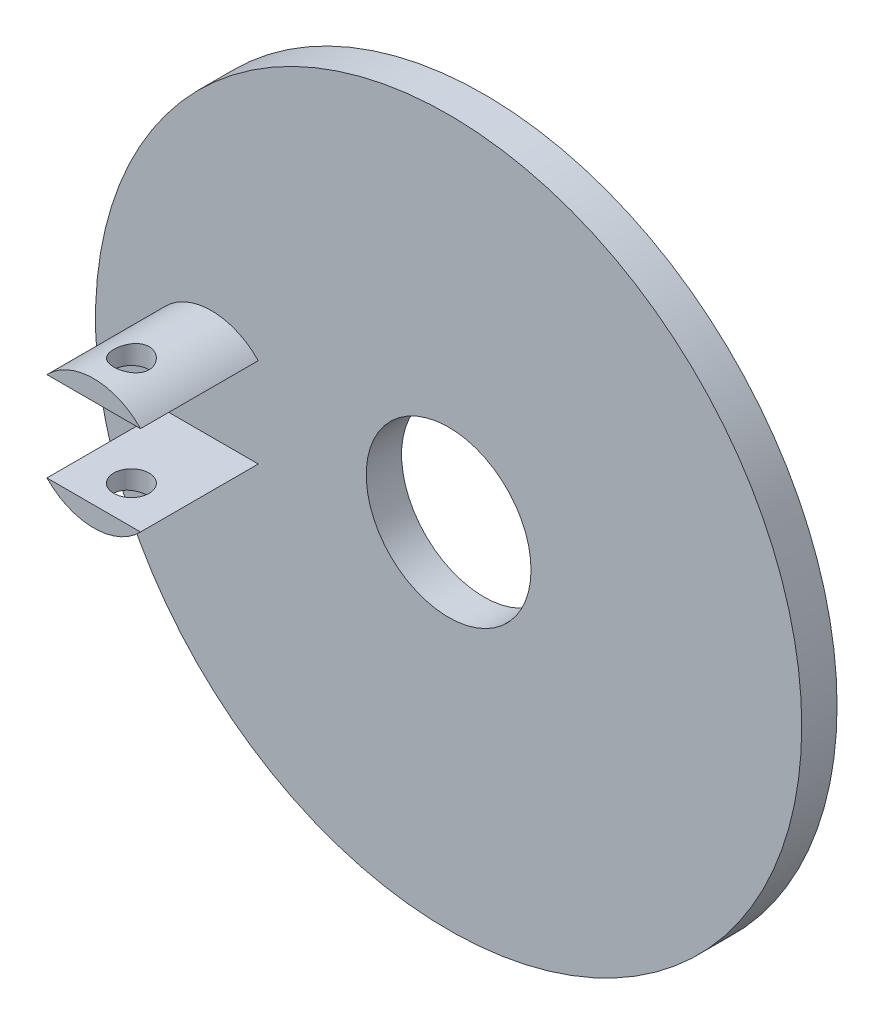
ISO-10303-21;
HEADER;
FILE_DESCRIPTION(('STEP AP214'),'2;1');
FILE_NAME('part.step','',(''),(''),'','','');
FILE_SCHEMA(('AUTOMOTIVE_DESIGN { 1 0 10303 214 1 1 1 1 }'));
ENDSEC;
DATA;
#1=APPLICATION_CONTEXT('core data for automotive mechanical design processes');
#2=APPLICATION_PROTOCOL_DEFINITION('international standard','automotive_design',2000,#1);
#3=PRODUCT_CONTEXT('',#1,'mechanical');
#4=PRODUCT('Part','Part','',(#3));
#5=PRODUCT_RELATED_PRODUCT_CATEGORY('part','',(#4));
#6=PRODUCT_DEFINITION_FORMATION('','',#4);
#7=PRODUCT_DEFINITION_CONTEXT('part definition',#1,'design');
#8=PRODUCT_DEFINITION('design','',#6,#7);
#9=PRODUCT_DEFINITION_SHAPE('','',#8);
#10=(LENGTH_UNIT() NAMED_UNIT(*) SI_UNIT(.MILLI.,.METRE.));
#11=(NAMED_UNIT(*) PLANE_ANGLE_UNIT() SI_UNIT($,.RADIAN.));
#12=(NAMED_UNIT(*) SI_UNIT($,.STERADIAN.) SOLID_ANGLE_UNIT());
#13=UNCERTAINTY_MEASURE_WITH_UNIT(LENGTH_MEASURE(1.E-05),#10,'distance_accuracy_value','');
#14=(GEOMETRIC_REPRESENTATION_CONTEXT(3) GLOBAL_UNCERTAINTY_ASSIGNED_CONTEXT((#13)) GLOBAL_UNIT_ASSIGNED_CONTEXT((#10,
#11,#12)) REPRESENTATION_CONTEXT('',''));
#15=CARTESIAN_POINT('',(0.,0.,0.));
#16=DIRECTION('',(0.,0.,1.));
#17=DIRECTION('',(1.,0.,0.));
#18=AXIS2_PLACEMENT_3D('',#15,#16,#17);
#19=CARTESIAN_POINT('',(-50.3744043567052,0.,32.5));
#20=DIRECTION('',(0.,0.,-1.));
#21=DIRECTION('',(-1.,0.,0.));
#22=AXIS2_PLACEMENT_3D('',#19,#20,#21);
#23=CYLINDRICAL_SURFACE('',#22,13.75);
#24=CARTESIAN_POINT('',(-50.3744043567052,13.75,28.25));
#25=CARTESIAN_POINT('',(-50.5809566400357,13.7499970679353,28.2499954684724));
#26=CARTESIAN_POINT('',(-50.787556803737,13.745300181519,28.2328773410415));
#27=CARTESIAN_POINT('',(-51.1947941820995,13.7270199521363,28.1649854242421));
#28=CARTESIAN_POINT('',(-51.3954286766484,13.7134326185125,28.1141965209285));
#29=CARTESIAN_POINT('',(-51.7847984218437,13.6788693043534,27.9807456706539));
#30=CARTESIAN_POINT('',(-51.9735490241306,13.6579030967349,27.8981258683452));
#31=CARTESIAN_POINT('',(-52.3345155971045,13.6107913603212,27.7035176683439));
#32=CARTESIAN_POINT('',(-52.5067302649297,13.5846454239129,27.5915269591152));
#33=CARTESIAN_POINT('',(-52.8338967256384,13.5292849260515,27.3385004088318));
#34=CARTESIAN_POINT('',(-52.9883921796301,13.5000160372607,27.1968863978645));
#35=CARTESIAN_POINT('',(-53.2717616987672,13.4420528233766,26.8898684099252));
#36=CARTESIAN_POINT('',(-53.4006323023233,13.4133585763801,26.7244612239942));
#37=CARTESIAN_POINT('',(-53.6313492201927,13.3592346040915,26.3708718810513));
#38=CARTESIAN_POINT('',(-53.7326650276449,13.3338732514656,26.1823321376593));
#39=CARTESIAN_POINT('',(-53.9019772657359,13.2900876852979,25.7900904295016));
#40=CARTESIAN_POINT('',(-53.9699801553763,13.2716621271439,25.5863914127788));
#41=CARTESIAN_POINT('',(-54.0691407677369,13.2443961798185,25.1746802624688));
#42=CARTESIAN_POINT('',(-54.101128370286,13.2353403070947,24.9668826295952));
#43=CARTESIAN_POINT('',(-54.1299384669336,13.2271957271021,24.548688292478));
#44=CARTESIAN_POINT('',(-54.1267678602273,13.2281050643315,24.33829210625));
#45=CARTESIAN_POINT('',(-54.0860091512128,13.2395956218864,23.9273961225843));
#46=CARTESIAN_POINT('',(-54.0494311984285,13.2498929578418,23.7267869134944));
#47=CARTESIAN_POINT('',(-53.9445164535004,13.2785438948515,23.334666784943));
#48=CARTESIAN_POINT('',(-53.8761770193214,13.2968981661038,23.1431566238343));
#49=CARTESIAN_POINT('',(-53.708870102367,13.3398404573081,22.7720661986314));
#50=CARTESIAN_POINT('',(-53.6095531537789,13.3644989941035,22.592651997416));
#51=CARTESIAN_POINT('',(-53.3833540572596,13.4172342199448,22.2526838814758));
#52=CARTESIAN_POINT('',(-53.2564662593605,13.4453116090812,22.0921338429031));
#53=CARTESIAN_POINT('',(-52.9735880237776,13.5028973747651,21.7886870254839));
#54=CARTESIAN_POINT('',(-52.8167509721234,13.5324218574279,21.6465813767777));
#55=CARTESIAN_POINT('',(-52.4811093861768,13.5887161926995,21.3905225875555));
#56=CARTESIAN_POINT('',(-52.3023039060016,13.6154859266073,21.2765706598759));
#57=CARTESIAN_POINT('',(-51.9265392410543,13.6634319530315,21.0796833180627));
#58=CARTESIAN_POINT('',(-51.7294984502497,13.6845812821826,20.9968966535401));
#59=CARTESIAN_POINT('',(-51.3235860784912,13.7187089035653,20.8658550687146));
#60=CARTESIAN_POINT('',(-51.1147172174994,13.7316890661141,20.8175922438897));
#61=CARTESIAN_POINT('',(-50.6978247829134,13.7477307194078,20.7582234555076));
#62=CARTESIAN_POINT('',(-50.4899651011652,13.7510790781342,20.7460425116991));
#63=CARTESIAN_POINT('',(-50.0751709426103,13.7483075396284,20.7562068687836));
#64=CARTESIAN_POINT('',(-49.868236367874,13.7421886695752,20.7785484240412));
#65=CARTESIAN_POINT('',(-49.4650416123563,13.7213559816487,20.8562437567578));
#66=CARTESIAN_POINT('',(-49.2686560460236,13.7067996618024,20.9109929818925));
#67=CARTESIAN_POINT('',(-48.8878796880836,13.6707480883919,21.0512431116013));
#68=CARTESIAN_POINT('',(-48.7034902284427,13.6492520658647,21.1367474241534));
#69=CARTESIAN_POINT('',(-48.3478014537188,13.6010393457039,21.338041105714));
#70=CARTESIAN_POINT('',(-48.176842850674,13.5742257387359,21.4544087181532));
#71=CARTESIAN_POINT('',(-47.8565038063779,13.518474710262,21.7134032188638));
#72=CARTESIAN_POINT('',(-47.7071278412602,13.4895368500677,21.8560355403964));
#73=CARTESIAN_POINT('',(-47.4296278480984,13.4317350389196,22.1685350950846));
#74=CARTESIAN_POINT('',(-47.3022636630283,13.4028986244354,22.3390834556873));
#75=CARTESIAN_POINT('',(-47.0779398015026,13.3495006548571,22.6997466180582));
#76=CARTESIAN_POINT('',(-46.9809789085436,13.3249389287407,22.8898606365564));
#77=CARTESIAN_POINT('',(-46.8209403987832,13.2831562169934,23.2833515705805));
#78=CARTESIAN_POINT('',(-46.7576705490722,13.2658937028182,23.4866456512007));
#79=CARTESIAN_POINT('',(-46.6663814262294,13.2406703654265,23.9015420949445));
#80=CARTESIAN_POINT('',(-46.6383526351345,13.2327070307137,24.1131421988357));
#81=CARTESIAN_POINT('',(-46.6189069672749,13.2272002418744,24.5308460095882));
#82=CARTESIAN_POINT('',(-46.6262660262878,13.2293083985106,24.7368889718698));
#83=CARTESIAN_POINT('',(-46.6745334156185,13.2428875416135,25.144676619382));
#84=CARTESIAN_POINT('',(-46.7154408059924,13.2543582657633,25.3464214248743));
#85=CARTESIAN_POINT('',(-46.8289191458226,13.2851579127739,25.7382657894222));
#86=CARTESIAN_POINT('',(-46.9012194704758,13.3044195782739,25.9284493830995));
#87=CARTESIAN_POINT('',(-47.0752217431718,13.3486297495706,26.2941331920382));
#88=CARTESIAN_POINT('',(-47.1769284940942,13.3735791841958,26.4696310026642));
#89=CARTESIAN_POINT('',(-47.4105185820836,13.4273094845813,26.8067764942303));
#90=CARTESIAN_POINT('',(-47.543231811152,13.4561843961411,26.9678342621074));
#91=CARTESIAN_POINT('',(-47.8335040767235,13.5139997622617,27.2657910169869));
#92=CARTESIAN_POINT('',(-47.9910692082353,13.54294023118,27.4026840600134));
#93=CARTESIAN_POINT('',(-48.33088504249,13.5984114794366,27.6514865362984));
#94=CARTESIAN_POINT('',(-48.5136146910489,13.6248726938459,27.7627587021674));
#95=CARTESIAN_POINT('',(-48.895904607107,13.6716315945094,27.9528310905287));
#96=CARTESIAN_POINT('',(-49.0954544756522,13.6919330537798,28.0316512013858));
#97=CARTESIAN_POINT('',(-49.4741541036597,13.7216048498941,28.1448487749475));
#98=CARTESIAN_POINT('',(-49.6517427560491,13.7321736920273,28.1841863781043));
#99=CARTESIAN_POINT('',(-50.0110103368515,13.7463721791088,28.2367625632971));
#100=CARTESIAN_POINT('',(-50.1926888177929,13.7500025795005,28.250003986637));
#101=CARTESIAN_POINT('',(-50.3744043567052,13.75,28.25));
#102=B_SPLINE_CURVE_WITH_KNOTS('',3,(#24,#25,#26,#27,#28,#29,#30,#31,#32,#33,#34,#35,#36,#37,
#38,#39,#40,#41,#42,#43,#44,#45,#46,#47,#48,#49,#50,#51,#52,#53,#54,#55,#56,#57,#58,#59,#60,#61,
#62,#63,#64,#65,#66,#67,#68,#69,#70,#71,#72,#73,#74,#75,#76,#77,#78,#79,#80,#81,#82,#83,#84,#85,
#86,#87,#88,#89,#90,#91,#92,#93,#94,#95,#96,#97,#98,#99,#100,#101),.UNSPECIFIED.,.T.,.F.,(4,2,2,
2,2,2,2,2,2,2,2,2,2,2,2,2,2,2,2,2,2,2,2,2,2,2,2,2,2,2,2,2,2,2,2,2,2,2,4),(0.,0.618990267137247,
1.23825857137825,1.85670975605145,2.47520962841177,3.10714695557947,3.73916959148309,
4.38261484125548,5.02593528477491,5.65410762152314,6.28215669241344,6.89182216687217,
7.50153836459292,8.1183981691982,8.73538450347804,9.37346321376938,10.0115694071106,
10.6526837434007,11.2936512441736,11.9153202835771,12.5369218776313,13.1472777800049,
13.7577013368959,14.380486725242,15.0034010914001,15.6447518266217,16.2860768966978,
16.9237024114271,17.5611556781934,18.1767213058417,18.7922696874019,19.4026138915576,
20.0130578381019,20.6422252849645,21.2715472777866,21.9151468073887,22.5583513153481,
23.102970802492,23.6475309891948),.UNSPECIFIED.);
#103=CARTESIAN_POINT('',(-50.3744043567052,13.75,28.25));
#104=VERTEX_POINT('',#103);
#105=EDGE_CURVE('E156',#104,#104,#102,.T.);
#106=ORIENTED_EDGE('',*,*,#105,.T.);
#107=EDGE_LOOP('',(#106));
#108=FACE_BOUND('',#107,.T.);
#109=DIRECTION('',(0.,0.,1.));
#110=VECTOR('',#109,1.);
#111=CARTESIAN_POINT('',(-60.3148520327408,9.5,-206.753354699524));
#112=LINE('',#111,#110);
#113=CARTESIAN_POINT('',(-60.3148520327408,9.5,7.50000000000001));
#114=VERTEX_POINT('',#113);
#115=CARTESIAN_POINT('',(-60.3148520327408,9.5,32.5));
#116=VERTEX_POINT('',#115);
#117=EDGE_CURVE('E92',#114,#116,#112,.T.);
#118=ORIENTED_EDGE('',*,*,#117,.T.);
#119=CARTESIAN_POINT('',(-50.3744043567052,0.,32.5));
#120=DIRECTION('',(0.,0.,1.));
#121=DIRECTION('',(1.,0.,0.));
#122=AXIS2_PLACEMENT_3D('',#119,#120,#121);
#123=CIRCLE('',#122,13.75);
#124=CARTESIAN_POINT('',(-40.4339566806697,9.5,32.5));
#125=VERTEX_POINT('',#124);
#126=EDGE_CURVE('E97',#125,#116,#123,.T.);
#127=ORIENTED_EDGE('',*,*,#126,.F.);
#128=DIRECTION('',(0.,0.,1.));
#129=VECTOR('',#128,1.);
#130=CARTESIAN_POINT('',(-40.4339566806697,9.5,-206.753354699524));
#131=LINE('',#130,#129);
#132=CARTESIAN_POINT('',(-40.4339566806697,9.5,7.50000000000001));
#133=VERTEX_POINT('',#132);
#134=EDGE_CURVE('E81',#133,#125,#131,.T.);
#135=ORIENTED_EDGE('',*,*,#134,.F.);
#136=CARTESIAN_POINT('',(-50.3744043567052,0.,7.5));
#137=DIRECTION('',(0.,0.,1.));
#138=DIRECTION('',(1.,0.,0.));
#139=AXIS2_PLACEMENT_3D('',#136,#137,#138);
#140=CIRCLE('',#139,13.75);
#141=EDGE_CURVE('E106',#133,#114,#140,.T.);
#142=ORIENTED_EDGE('',*,*,#141,.T.);
#143=EDGE_LOOP('',(#118,#127,#135,#142));
#144=FACE_BOUND('',#143,.T.);
#145=ADVANCED_FACE('F41',(#108,#144),#23,.T.);
#146=CARTESIAN_POINT('',(-50.3744043567052,-13.75,28.25));
#147=CARTESIAN_POINT('',(-50.1678520733747,-13.7499970679353,28.2499954684724));
#148=CARTESIAN_POINT('',(-49.9612519096735,-13.745300181519,28.2328773410415));
#149=CARTESIAN_POINT('',(-49.554014531311,-13.7270199521363,28.1649854242421));
#150=CARTESIAN_POINT('',(-49.3533800367621,-13.7134326185125,28.1141965209285));
#151=CARTESIAN_POINT('',(-48.9640102915667,-13.6788693043534,27.9807456706539));
#152=CARTESIAN_POINT('',(-48.7752596892798,-13.6579030967349,27.8981258683452));
#153=CARTESIAN_POINT('',(-48.4142931163059,-13.6107913603212,27.7035176683439));
#154=CARTESIAN_POINT('',(-48.2420784484808,-13.5846454239129,27.5915269591152));
#155=CARTESIAN_POINT('',(-47.9149119877721,-13.5292849260515,27.3385004088318));
#156=CARTESIAN_POINT('',(-47.7604165337804,-13.5000160372607,27.1968863978645));
#157=CARTESIAN_POINT('',(-47.4770470146433,-13.4420528233766,26.8898684099252));
#158=CARTESIAN_POINT('',(-47.3481764110872,-13.4133585763801,26.7244612239942));
#159=CARTESIAN_POINT('',(-47.1174594932178,-13.3592346040915,26.3708718810513));
#160=CARTESIAN_POINT('',(-47.0161436857656,-13.3338732514656,26.1823321376593));
#161=CARTESIAN_POINT('',(-46.8468314476745,-13.2900876852979,25.7900904295016));
#162=CARTESIAN_POINT('',(-46.7788285580341,-13.2716621271439,25.5863914127788));
#163=CARTESIAN_POINT('',(-46.6796679456735,-13.2443961798185,25.1746802624688));
#164=CARTESIAN_POINT('',(-46.6476803431245,-13.2353403070947,24.9668826295952));
#165=CARTESIAN_POINT('',(-46.6188702464769,-13.2271957271021,24.548688292478));
#166=CARTESIAN_POINT('',(-46.6220408531832,-13.2281050643315,24.33829210625));
#167=CARTESIAN_POINT('',(-46.6627995621977,-13.2395956218864,23.9273961225843));
#168=CARTESIAN_POINT('',(-46.6993775149819,-13.2498929578418,23.7267869134944));
#169=CARTESIAN_POINT('',(-46.8042922599101,-13.2785438948515,23.334666784943));
#170=CARTESIAN_POINT('',(-46.8726316940891,-13.2968981661038,23.1431566238343));
#171=CARTESIAN_POINT('',(-47.0399386110435,-13.3398404573081,22.7720661986314));
#172=CARTESIAN_POINT('',(-47.1392555596316,-13.3644989941035,22.592651997416));
#173=CARTESIAN_POINT('',(-47.3654546561509,-13.4172342199448,22.2526838814758));
#174=CARTESIAN_POINT('',(-47.49234245405,-13.4453116090812,22.0921338429031));
#175=CARTESIAN_POINT('',(-47.7752206896328,-13.5028973747651,21.7886870254839));
#176=CARTESIAN_POINT('',(-47.9320577412871,-13.5324218574279,21.6465813767777));
#177=CARTESIAN_POINT('',(-48.2676993272337,-13.5887161926995,21.3905225875555));
#178=CARTESIAN_POINT('',(-48.4465048074089,-13.6154859266073,21.2765706598759));
#179=CARTESIAN_POINT('',(-48.8222694723562,-13.6634319530315,21.0796833180627));
#180=CARTESIAN_POINT('',(-49.0193102631608,-13.6845812821826,20.9968966535401));
#181=CARTESIAN_POINT('',(-49.4252226349193,-13.7187089035653,20.8658550687146));
#182=CARTESIAN_POINT('',(-49.634091495911,-13.7316890661141,20.8175922438897));
#183=CARTESIAN_POINT('',(-50.0509839304971,-13.7477307194078,20.7582234555076));
#184=CARTESIAN_POINT('',(-50.2588436122453,-13.7510790781342,20.7460425116991));
#185=CARTESIAN_POINT('',(-50.6736377708002,-13.7483075396284,20.7562068687836));
#186=CARTESIAN_POINT('',(-50.8805723455365,-13.7421886695752,20.7785484240412));
#187=CARTESIAN_POINT('',(-51.2837671010541,-13.7213559816487,20.8562437567578));
#188=CARTESIAN_POINT('',(-51.4801526673869,-13.7067996618024,20.9109929818925));
#189=CARTESIAN_POINT('',(-51.8609290253268,-13.6707480883919,21.0512431116013));
#190=CARTESIAN_POINT('',(-52.0453184849678,-13.6492520658647,21.1367474241534));
#191=CARTESIAN_POINT('',(-52.4010072596916,-13.6010393457039,21.338041105714));
#192=CARTESIAN_POINT('',(-52.5719658627364,-13.5742257387359,21.4544087181532));
#193=CARTESIAN_POINT('',(-52.8923049070325,-13.518474710262,21.7134032188638));
#194=CARTESIAN_POINT('',(-53.0416808721502,-13.4895368500677,21.8560355403964));
#195=CARTESIAN_POINT('',(-53.3191808653121,-13.4317350389196,22.1685350950846));
#196=CARTESIAN_POINT('',(-53.4465450503822,-13.4028986244354,22.3390834556873));
#197=CARTESIAN_POINT('',(-53.6708689119078,-13.3495006548571,22.6997466180582));
#198=CARTESIAN_POINT('',(-53.7678298048668,-13.3249389287407,22.8898606365564));
#199=CARTESIAN_POINT('',(-53.9278683146273,-13.2831562169934,23.2833515705805));
#200=CARTESIAN_POINT('',(-53.9911381643382,-13.2658937028182,23.4866456512007));
#201=CARTESIAN_POINT('',(-54.0824272871811,-13.2406703654265,23.9015420949445));
#202=CARTESIAN_POINT('',(-54.110456078276,-13.2327070307137,24.1131421988357));
#203=CARTESIAN_POINT('',(-54.1299017461355,-13.2272002418744,24.5308460095882));
#204=CARTESIAN_POINT('',(-54.1225426871227,-13.2293083985106,24.7368889718698));
#205=CARTESIAN_POINT('',(-54.0742752977919,-13.2428875416135,25.144676619382));
#206=CARTESIAN_POINT('',(-54.0333679074181,-13.2543582657633,25.3464214248743));
#207=CARTESIAN_POINT('',(-53.9198895675879,-13.2851579127739,25.7382657894222));
#208=CARTESIAN_POINT('',(-53.8475892429347,-13.3044195782739,25.9284493830995));
#209=CARTESIAN_POINT('',(-53.6735869702386,-13.3486297495706,26.2941331920382));
#210=CARTESIAN_POINT('',(-53.5718802193163,-13.3735791841958,26.4696310026642));
#211=CARTESIAN_POINT('',(-53.3382901313269,-13.4273094845813,26.8067764942303));
#212=CARTESIAN_POINT('',(-53.2055769022584,-13.4561843961411,26.9678342621074));
#213=CARTESIAN_POINT('',(-52.915304636687,-13.5139997622617,27.2657910169869));
#214=CARTESIAN_POINT('',(-52.7577395051752,-13.54294023118,27.4026840600134));
#215=CARTESIAN_POINT('',(-52.4179236709205,-13.5984114794366,27.6514865362984));
#216=CARTESIAN_POINT('',(-52.2351940223615,-13.6248726938459,27.7627587021674));
#217=CARTESIAN_POINT('',(-51.8529041063034,-13.6716315945094,27.9528310905287));
#218=CARTESIAN_POINT('',(-51.6533542377583,-13.6919330537798,28.0316512013858));
#219=CARTESIAN_POINT('',(-51.2746546097508,-13.7216048498941,28.1448487749475));
#220=CARTESIAN_POINT('',(-51.0970659573614,-13.7321736920273,28.1841863781043));
#221=CARTESIAN_POINT('',(-50.7377983765589,-13.7463721791088,28.2367625632971));
#222=CARTESIAN_POINT('',(-50.5561198956176,-13.7500025795005,28.250003986637));
#223=CARTESIAN_POINT('',(-50.3744043567052,-13.75,28.25));
#224=B_SPLINE_CURVE_WITH_KNOTS('',3,(#146,#147,#148,#149,#150,#151,#152,#153,#154,#155,#156,
#157,#158,#159,#160,#161,#162,#163,#164,#165,#166,#167,#168,#169,#170,#171,#172,#173,#174,#175,
#176,#177,#178,#179,#180,#181,#182,#183,#184,#185,#186,#187,#188,#189,#190,#191,#192,#193,#194,
#195,#196,#197,#198,#199,#200,#201,#202,#203,#204,#205,#206,#207,#208,#209,#210,#211,#212,#213,
#214,#215,#216,#217,#218,#219,#220,#221,#222,#223),.UNSPECIFIED.,.T.,.F.,(4,2,2,2,2,2,2,2,2,2,2,
2,2,2,2,2,2,2,2,2,2,2,2,2,2,2,2,2,2,2,2,2,2,2,2,2,2,2,4),(0.,0.618990267137247,1.23825857137825,
1.85670975605145,2.47520962841177,3.10714695557946,3.73916959148309,4.38261484125548,
5.02593528477491,5.65410762152314,6.28215669241344,6.89182216687217,7.50153836459292,
8.1183981691982,8.73538450347803,9.37346321376937,10.0115694071106,10.6526837434007,
11.2936512441736,11.9153202835771,12.5369218776313,13.1472777800049,13.7577013368959,
14.380486725242,15.0034010914001,15.6447518266217,16.2860768966978,16.9237024114271,
17.5611556781934,18.1767213058417,18.7922696874019,19.4026138915576,20.0130578381019,
20.6422252849645,21.2715472777866,21.9151468073887,22.5583513153481,23.102970802492,
23.6475309891948),.UNSPECIFIED.);
#225=CARTESIAN_POINT('',(-50.3744043567052,-13.75,28.25));
#226=VERTEX_POINT('',#225);
#227=EDGE_CURVE('E149',#226,#226,#224,.T.);
#228=ORIENTED_EDGE('',*,*,#227,.T.);
#229=EDGE_LOOP('',(#228));
#230=FACE_BOUND('',#229,.T.);
#231=DIRECTION('',(0.,0.,1.));
#232=VECTOR('',#231,1.);
#233=CARTESIAN_POINT('',(-40.4339566806697,-9.5,-206.753354699524));
#234=LINE('',#233,#232);
#235=CARTESIAN_POINT('',(-40.4339566806697,-9.5,7.50000000000001));
#236=VERTEX_POINT('',#235);
#237=CARTESIAN_POINT('',(-40.4339566806697,-9.5,32.5));
#238=VERTEX_POINT('',#237);
#239=EDGE_CURVE('E188',#236,#238,#234,.T.);
#240=ORIENTED_EDGE('',*,*,#239,.T.);
#241=CARTESIAN_POINT('',(-60.3148520327408,-9.5,32.5));
#242=VERTEX_POINT('',#241);
#243=EDGE_CURVE('E100',#242,#238,#123,.T.);
#244=ORIENTED_EDGE('',*,*,#243,.F.);
#245=DIRECTION('',(0.,0.,1.));
#246=VECTOR('',#245,1.);
#247=CARTESIAN_POINT('',(-60.3148520327408,-9.5,-206.753354699524));
#248=LINE('',#247,#246);
#249=CARTESIAN_POINT('',(-60.3148520327408,-9.5,7.50000000000001));
#250=VERTEX_POINT('',#249);
#251=EDGE_CURVE('E58',#250,#242,#248,.T.);
#252=ORIENTED_EDGE('',*,*,#251,.F.);
#253=EDGE_CURVE('E111',#250,#236,#140,.T.);
#254=ORIENTED_EDGE('',*,*,#253,.T.);
#255=EDGE_LOOP('',(#240,#244,#252,#254));
#256=FACE_BOUND('',#255,.T.);
#257=ADVANCED_FACE('F138',(#230,#256),#23,.T.);
#258=CARTESIAN_POINT('',(-50.3744043567052,0.,32.5));
#259=DIRECTION('',(0.,0.,1.));
#260=DIRECTION('',(1.,0.,0.));
#261=AXIS2_PLACEMENT_3D('',#258,#259,#260);
#262=PLANE('',#261);
#263=ORIENTED_EDGE('',*,*,#126,.T.);
#264=DIRECTION('',(1.,0.,0.));
#265=VECTOR('',#264,1.);
#266=CARTESIAN_POINT('',(-60.3148520327408,9.5,32.5));
#267=LINE('',#266,#265);
#268=EDGE_CURVE('E84',#116,#125,#267,.T.);
#269=ORIENTED_EDGE('',*,*,#268,.T.);
#270=EDGE_LOOP('',(#263,#269));
#271=FACE_BOUND('',#270,.T.);
#272=ADVANCED_FACE('F96',(#271),#262,.T.);
#273=ORIENTED_EDGE('',*,*,#243,.T.);
#274=DIRECTION('',(-1.,0.,0.));
#275=VECTOR('',#274,1.);
#276=CARTESIAN_POINT('',(-60.3148520327408,-9.5,32.5));
#277=LINE('',#276,#275);
#278=EDGE_CURVE('E161',#238,#242,#277,.T.);
#279=ORIENTED_EDGE('',*,*,#278,.T.);
#280=EDGE_LOOP('',(#273,#279));
#281=FACE_BOUND('',#280,.T.);
#282=ADVANCED_FACE('F192',(#281),#262,.T.);
#283=CARTESIAN_POINT('',(0.,0.,7.5));
#284=DIRECTION('',(0.,0.,1.));
#285=DIRECTION('',(1.,0.,0.));
#286=AXIS2_PLACEMENT_3D('',#283,#284,#285);
#287=PLANE('',#286);
#288=ORIENTED_EDGE('',*,*,#253,.F.);
#289=DIRECTION('',(1.,0.,0.));
#290=VECTOR('',#289,1.);
#291=CARTESIAN_POINT('',(-60.3148520327408,-9.5,7.50000000000001));
#292=LINE('',#291,#290);
#293=EDGE_CURVE('E64',#250,#236,#292,.T.);
#294=ORIENTED_EDGE('',*,*,#293,.T.);
#295=EDGE_LOOP('',(#288,#294));
#296=FACE_BOUND('',#295,.T.);
#297=ORIENTED_EDGE('',*,*,#141,.F.);
#298=DIRECTION('',(-1.,0.,0.));
#299=VECTOR('',#298,1.);
#300=CARTESIAN_POINT('',(-60.3148520327408,9.5,7.50000000000001));
#301=LINE('',#300,#299);
#302=EDGE_CURVE('E87',#133,#114,#301,.T.);
#303=ORIENTED_EDGE('',*,*,#302,.T.);
#304=EDGE_LOOP('',(#297,#303));
#305=FACE_BOUND('',#304,.T.);
#306=CARTESIAN_POINT('',(0.,0.,7.5));
#307=DIRECTION('',(0.,0.,1.));
#308=DIRECTION('',(1.,0.,0.));
#309=AXIS2_PLACEMENT_3D('',#306,#307,#308);
#310=CIRCLE('',#309,75.);
#311=CARTESIAN_POINT('',(75.,0.,7.5));
#312=VERTEX_POINT('',#311);
#313=EDGE_CURVE('E12',#312,#312,#310,.T.);
#314=ORIENTED_EDGE('',*,*,#313,.T.);
#315=EDGE_LOOP('',(#314));
#316=FACE_BOUND('',#315,.T.);
#317=CARTESIAN_POINT('',(0.,0.,7.5));
#318=DIRECTION('',(0.,0.,1.));
#319=DIRECTION('',(1.,0.,0.));
#320=AXIS2_PLACEMENT_3D('',#317,#318,#319);
#321=CIRCLE('',#320,17.5);
#322=CARTESIAN_POINT('',(17.5,0.,7.5));
#323=VERTEX_POINT('',#322);
#324=EDGE_CURVE('E103',#323,#323,#321,.T.);
#325=ORIENTED_EDGE('',*,*,#324,.F.);
#326=EDGE_LOOP('',(#325));
#327=FACE_BOUND('',#326,.T.);
#328=ADVANCED_FACE('F120',(#296,#305,#316,#327),#287,.T.);
#329=CARTESIAN_POINT('',(0.,0.,0.));
#330=DIRECTION('',(0.,0.,1.));
#331=DIRECTION('',(1.,0.,0.));
#332=AXIS2_PLACEMENT_3D('',#329,#330,#331);
#333=PLANE('',#332);
#334=CARTESIAN_POINT('',(0.,0.,0.));
#335=DIRECTION('',(0.,0.,1.));
#336=DIRECTION('',(1.,0.,0.));
#337=AXIS2_PLACEMENT_3D('',#334,#335,#336);
#338=CIRCLE('',#337,75.);
#339=CARTESIAN_POINT('',(75.,0.,0.));
#340=VERTEX_POINT('',#339);
#341=EDGE_CURVE('E50',#340,#340,#338,.T.);
#342=ORIENTED_EDGE('',*,*,#341,.F.);
#343=EDGE_LOOP('',(#342));
#344=FACE_BOUND('',#343,.T.);
#345=CARTESIAN_POINT('',(0.,0.,0.));
#346=DIRECTION('',(0.,0.,1.));
#347=DIRECTION('',(1.,0.,0.));
#348=AXIS2_PLACEMENT_3D('',#345,#346,#347);
#349=CIRCLE('',#348,17.5);
#350=CARTESIAN_POINT('',(17.5,0.,0.));
#351=VERTEX_POINT('',#350);
#352=EDGE_CURVE('E99',#351,#351,#349,.T.);
#353=ORIENTED_EDGE('',*,*,#352,.T.);
#354=EDGE_LOOP('',(#353));
#355=FACE_BOUND('',#354,.T.);
#356=ADVANCED_FACE('F117',(#344,#355),#333,.F.);
#357=CARTESIAN_POINT('',(0.,0.,7.5));
#358=DIRECTION('',(0.,0.,-1.));
#359=DIRECTION('',(-1.,0.,0.));
#360=AXIS2_PLACEMENT_3D('',#357,#358,#359);
#361=CYLINDRICAL_SURFACE('',#360,75.);
#362=ORIENTED_EDGE('',*,*,#313,.F.);
#363=EDGE_LOOP('',(#362));
#364=FACE_BOUND('',#363,.T.);
#365=ORIENTED_EDGE('',*,*,#341,.T.);
#366=EDGE_LOOP('',(#365));
#367=FACE_BOUND('',#366,.T.);
#368=ADVANCED_FACE('F43',(#364,#367),#361,.T.);
#369=CARTESIAN_POINT('',(0.,0.,7.5));
#370=DIRECTION('',(0.,0.,-1.));
#371=DIRECTION('',(-1.,0.,0.));
#372=AXIS2_PLACEMENT_3D('',#369,#370,#371);
#373=CYLINDRICAL_SURFACE('',#372,17.5);
#374=ORIENTED_EDGE('',*,*,#324,.T.);
#375=EDGE_LOOP('',(#374));
#376=FACE_BOUND('',#375,.T.);
#377=ORIENTED_EDGE('',*,*,#352,.F.);
#378=EDGE_LOOP('',(#377));
#379=FACE_BOUND('',#378,.T.);
#380=ADVANCED_FACE('F123',(#376,#379),#373,.F.);
#381=CARTESIAN_POINT('',(-60.3148520327408,9.5,-206.753354699524));
#382=DIRECTION('',(0.,-1.,0.));
#383=DIRECTION('',(0.,0.,-1.));
#384=AXIS2_PLACEMENT_3D('',#381,#382,#383);
#385=PLANE('',#384);
#386=CARTESIAN_POINT('',(-50.3744043567052,9.49999999999999,24.5));
#387=DIRECTION('',(0.,-1.,0.));
#388=DIRECTION('',(0.,0.,-1.));
#389=AXIS2_PLACEMENT_3D('',#386,#387,#388);
#390=CIRCLE('',#389,3.75);
#391=CARTESIAN_POINT('',(-50.3744043567052,9.49999999999999,20.75));
#392=VERTEX_POINT('',#391);
#393=EDGE_CURVE('E178',#392,#392,#390,.T.);
#394=ORIENTED_EDGE('',*,*,#393,.F.);
#395=EDGE_LOOP('',(#394));
#396=FACE_BOUND('',#395,.T.);
#397=ORIENTED_EDGE('',*,*,#134,.T.);
#398=ORIENTED_EDGE('',*,*,#268,.F.);
#399=ORIENTED_EDGE('',*,*,#117,.F.);
#400=ORIENTED_EDGE('',*,*,#302,.F.);
#401=EDGE_LOOP('',(#397,#398,#399,#400));
#402=FACE_BOUND('',#401,.T.);
#403=ADVANCED_FACE('F83',(#396,#402),#385,.T.);
#404=CARTESIAN_POINT('',(-60.3148520327408,-9.5,-206.753354699524));
#405=DIRECTION('',(0.,1.,0.));
#406=DIRECTION('',(0.,0.,1.));
#407=AXIS2_PLACEMENT_3D('',#404,#405,#406);
#408=PLANE('',#407);
#409=CARTESIAN_POINT('',(-50.3744043567052,-9.49999999999999,24.5));
#410=DIRECTION('',(0.,1.,0.));
#411=DIRECTION('',(0.,0.,1.));
#412=AXIS2_PLACEMENT_3D('',#409,#410,#411);
#413=CIRCLE('',#412,3.75);
#414=CARTESIAN_POINT('',(-50.3744043567052,-9.49999999999999,28.25));
#415=VERTEX_POINT('',#414);
#416=EDGE_CURVE('E45',#415,#415,#413,.T.);
#417=ORIENTED_EDGE('',*,*,#416,.F.);
#418=EDGE_LOOP('',(#417));
#419=FACE_BOUND('',#418,.T.);
#420=ORIENTED_EDGE('',*,*,#251,.T.);
#421=ORIENTED_EDGE('',*,*,#278,.F.);
#422=ORIENTED_EDGE('',*,*,#239,.F.);
#423=ORIENTED_EDGE('',*,*,#293,.F.);
#424=EDGE_LOOP('',(#420,#421,#422,#423));
#425=FACE_BOUND('',#424,.T.);
#426=ADVANCED_FACE('F131',(#419,#425),#408,.T.);
#427=CARTESIAN_POINT('',(-50.3744043567052,-75.,24.5));
#428=DIRECTION('',(0.,1.,0.));
#429=DIRECTION('',(0.,0.,1.));
#430=AXIS2_PLACEMENT_3D('',#427,#428,#429);
#431=CYLINDRICAL_SURFACE('',#430,3.75);
#432=ORIENTED_EDGE('',*,*,#416,.T.);
#433=EDGE_LOOP('',(#432));
#434=FACE_BOUND('',#433,.T.);
#435=ORIENTED_EDGE('',*,*,#227,.F.);
#436=EDGE_LOOP('',(#435));
#437=FACE_BOUND('',#436,.T.);
#438=ADVANCED_FACE('F167',(#434,#437),#431,.F.);
#439=ORIENTED_EDGE('',*,*,#393,.T.);
#440=EDGE_LOOP('',(#439));
#441=FACE_BOUND('',#440,.T.);
#442=ORIENTED_EDGE('',*,*,#105,.F.);
#443=EDGE_LOOP('',(#442));
#444=FACE_BOUND('',#443,.T.);
#445=ADVANCED_FACE('F163',(#441,#444),#431,.F.);
#446=CLOSED_SHELL('',(#145,#257,#272,#282,#328,#356,#368,#380,#403,#426,#438,#445));
#447=MANIFOLD_SOLID_BREP('B2',#446);
#448=ADVANCED_BREP_SHAPE_REPRESENTATION('',(#18,#447),#14);
#449=SHAPE_DEFINITION_REPRESENTATION(#9,#448);
ENDSEC;
END-ISO-10303-21;
